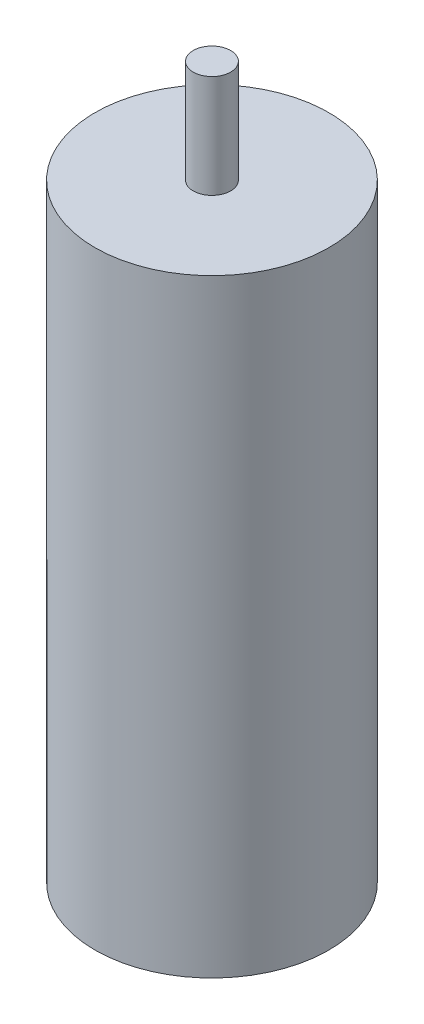
ISO-10303-21;
HEADER;
FILE_DESCRIPTION(('STEP AP214'),'2;1');
FILE_NAME('part.step','',(''),(''),'','','');
FILE_SCHEMA(('AUTOMOTIVE_DESIGN { 1 0 10303 214 1 1 1 1 }'));
ENDSEC;
DATA;
#1=APPLICATION_CONTEXT('core data for automotive mechanical design processes');
#2=APPLICATION_PROTOCOL_DEFINITION('international standard','automotive_design',2000,#1);
#3=PRODUCT_CONTEXT('',#1,'mechanical');
#4=PRODUCT('Part','Part','',(#3));
#5=PRODUCT_RELATED_PRODUCT_CATEGORY('part','',(#4));
#6=PRODUCT_DEFINITION_FORMATION('','',#4);
#7=PRODUCT_DEFINITION_CONTEXT('part definition',#1,'design');
#8=PRODUCT_DEFINITION('design','',#6,#7);
#9=PRODUCT_DEFINITION_SHAPE('','',#8);
#10=(LENGTH_UNIT() NAMED_UNIT(*) SI_UNIT(.MILLI.,.METRE.));
#11=(NAMED_UNIT(*) PLANE_ANGLE_UNIT() SI_UNIT($,.RADIAN.));
#12=(NAMED_UNIT(*) SI_UNIT($,.STERADIAN.) SOLID_ANGLE_UNIT());
#13=UNCERTAINTY_MEASURE_WITH_UNIT(LENGTH_MEASURE(1.E-05),#10,'distance_accuracy_value','');
#14=(GEOMETRIC_REPRESENTATION_CONTEXT(3) GLOBAL_UNCERTAINTY_ASSIGNED_CONTEXT((#13)) GLOBAL_UNIT_ASSIGNED_CONTEXT((#10,
#11,#12)) REPRESENTATION_CONTEXT('',''));
#15=CARTESIAN_POINT('',(0.,0.,0.));
#16=DIRECTION('',(0.,0.,1.));
#17=DIRECTION('',(1.,0.,0.));
#18=AXIS2_PLACEMENT_3D('',#15,#16,#17);
#19=CARTESIAN_POINT('',(0.,65.,0.));
#20=DIRECTION('',(0.,-1.,0.));
#21=DIRECTION('',(0.,0.,-1.));
#22=AXIS2_PLACEMENT_3D('',#19,#20,#21);
#23=CYLINDRICAL_SURFACE('',#22,12.5);
#24=CARTESIAN_POINT('',(0.,65.,0.));
#25=DIRECTION('',(0.,1.,0.));
#26=DIRECTION('',(0.,0.,1.));
#27=AXIS2_PLACEMENT_3D('',#24,#25,#26);
#28=CIRCLE('',#27,12.5);
#29=CARTESIAN_POINT('',(0.,65.,12.5));
#30=VERTEX_POINT('',#29);
#31=EDGE_CURVE('E37',#30,#30,#28,.T.);
#32=ORIENTED_EDGE('',*,*,#31,.F.);
#33=EDGE_LOOP('',(#32));
#34=FACE_BOUND('',#33,.T.);
#35=CARTESIAN_POINT('',(0.,0.,0.));
#36=DIRECTION('',(0.,1.,0.));
#37=DIRECTION('',(0.,0.,1.));
#38=AXIS2_PLACEMENT_3D('',#35,#36,#37);
#39=CIRCLE('',#38,12.5);
#40=CARTESIAN_POINT('',(0.,0.,12.5));
#41=VERTEX_POINT('',#40);
#42=EDGE_CURVE('E33',#41,#41,#39,.T.);
#43=ORIENTED_EDGE('',*,*,#42,.T.);
#44=EDGE_LOOP('',(#43));
#45=FACE_BOUND('',#44,.T.);
#46=ADVANCED_FACE('F30',(#34,#45),#23,.T.);
#47=CARTESIAN_POINT('',(0.,65.,0.));
#48=DIRECTION('',(0.,1.,0.));
#49=DIRECTION('',(0.,0.,1.));
#50=AXIS2_PLACEMENT_3D('',#47,#48,#49);
#51=PLANE('',#50);
#52=CARTESIAN_POINT('',(0.,65.,0.));
#53=DIRECTION('',(0.,1.,0.));
#54=DIRECTION('',(0.,0.,1.));
#55=AXIS2_PLACEMENT_3D('',#52,#53,#54);
#56=CIRCLE('',#55,2.);
#57=CARTESIAN_POINT('',(0.,65.,2.));
#58=VERTEX_POINT('',#57);
#59=EDGE_CURVE('E10',#58,#58,#56,.T.);
#60=ORIENTED_EDGE('',*,*,#59,.F.);
#61=EDGE_LOOP('',(#60));
#62=FACE_BOUND('',#61,.T.);
#63=ORIENTED_EDGE('',*,*,#31,.T.);
#64=EDGE_LOOP('',(#63));
#65=FACE_BOUND('',#64,.T.);
#66=ADVANCED_FACE('F54',(#62,#65),#51,.T.);
#67=CARTESIAN_POINT('',(0.,0.,0.));
#68=DIRECTION('',(0.,1.,0.));
#69=DIRECTION('',(0.,0.,1.));
#70=AXIS2_PLACEMENT_3D('',#67,#68,#69);
#71=PLANE('',#70);
#72=ORIENTED_EDGE('',*,*,#42,.F.);
#73=EDGE_LOOP('',(#72));
#74=FACE_BOUND('',#73,.T.);
#75=ADVANCED_FACE('F51',(#74),#71,.F.);
#76=CARTESIAN_POINT('',(0.,76.,0.));
#77=DIRECTION('',(0.,-1.,0.));
#78=DIRECTION('',(0.,0.,-1.));
#79=AXIS2_PLACEMENT_3D('',#76,#77,#78);
#80=CYLINDRICAL_SURFACE('',#79,2.);
#81=CARTESIAN_POINT('',(0.,76.,0.));
#82=DIRECTION('',(0.,1.,0.));
#83=DIRECTION('',(0.,0.,1.));
#84=AXIS2_PLACEMENT_3D('',#81,#82,#83);
#85=CIRCLE('',#84,2.);
#86=CARTESIAN_POINT('',(0.,76.,2.));
#87=VERTEX_POINT('',#86);
#88=EDGE_CURVE('E43',#87,#87,#85,.T.);
#89=ORIENTED_EDGE('',*,*,#88,.F.);
#90=EDGE_LOOP('',(#89));
#91=FACE_BOUND('',#90,.T.);
#92=ORIENTED_EDGE('',*,*,#59,.T.);
#93=EDGE_LOOP('',(#92));
#94=FACE_BOUND('',#93,.T.);
#95=ADVANCED_FACE('F53',(#91,#94),#80,.T.);
#96=CARTESIAN_POINT('',(0.,76.,0.));
#97=DIRECTION('',(0.,1.,0.));
#98=DIRECTION('',(0.,0.,1.));
#99=AXIS2_PLACEMENT_3D('',#96,#97,#98);
#100=PLANE('',#99);
#101=ORIENTED_EDGE('',*,*,#88,.T.);
#102=EDGE_LOOP('',(#101));
#103=FACE_BOUND('',#102,.T.);
#104=ADVANCED_FACE('F59',(#103),#100,.T.);
#105=CLOSED_SHELL('',(#46,#66,#75,#95,#104));
#106=MANIFOLD_SOLID_BREP('B2',#105);
#107=ADVANCED_BREP_SHAPE_REPRESENTATION('',(#18,#106),#14);
#108=SHAPE_DEFINITION_REPRESENTATION(#9,#107);
ENDSEC;
END-ISO-10303-21;
